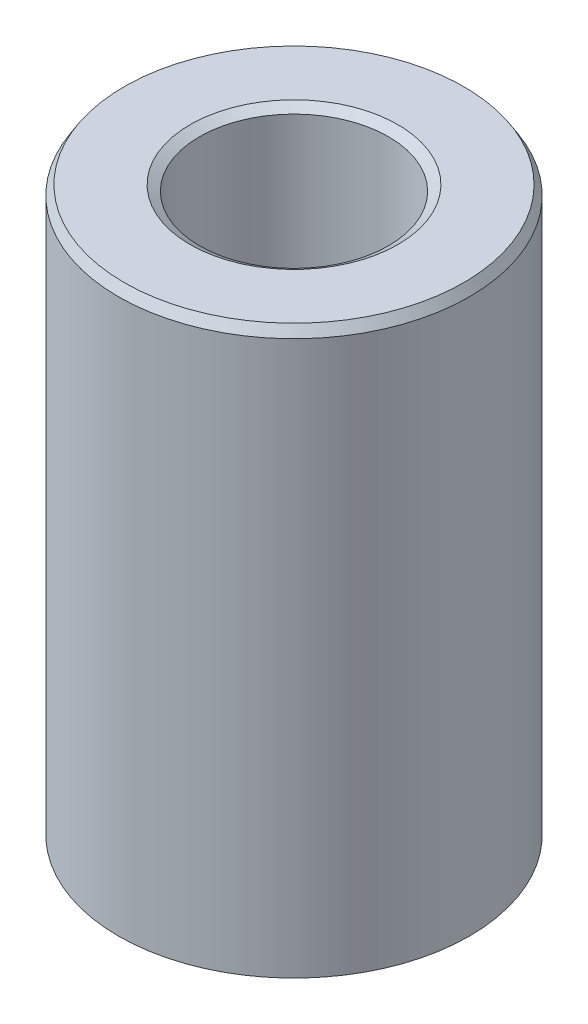
ISO-10303-21;
HEADER;
FILE_DESCRIPTION(('STEP AP214'),'2;1');
FILE_NAME('part.step','',(''),(''),'','','');
FILE_SCHEMA(('AUTOMOTIVE_DESIGN { 1 0 10303 214 1 1 1 1 }'));
ENDSEC;
DATA;
#1=APPLICATION_CONTEXT('core data for automotive mechanical design processes');
#2=APPLICATION_PROTOCOL_DEFINITION('international standard','automotive_design',2000,#1);
#3=PRODUCT_CONTEXT('',#1,'mechanical');
#4=PRODUCT('Part','Part','',(#3));
#5=PRODUCT_RELATED_PRODUCT_CATEGORY('part','',(#4));
#6=PRODUCT_DEFINITION_FORMATION('','',#4);
#7=PRODUCT_DEFINITION_CONTEXT('part definition',#1,'design');
#8=PRODUCT_DEFINITION('design','',#6,#7);
#9=PRODUCT_DEFINITION_SHAPE('','',#8);
#10=(LENGTH_UNIT() NAMED_UNIT(*) SI_UNIT(.MILLI.,.METRE.));
#11=(NAMED_UNIT(*) PLANE_ANGLE_UNIT() SI_UNIT($,.RADIAN.));
#12=(NAMED_UNIT(*) SI_UNIT($,.STERADIAN.) SOLID_ANGLE_UNIT());
#13=UNCERTAINTY_MEASURE_WITH_UNIT(LENGTH_MEASURE(1.E-05),#10,'distance_accuracy_value','');
#14=(GEOMETRIC_REPRESENTATION_CONTEXT(3) GLOBAL_UNCERTAINTY_ASSIGNED_CONTEXT((#13)) GLOBAL_UNIT_ASSIGNED_CONTEXT((#10,
#11,#12)) REPRESENTATION_CONTEXT('',''));
#15=CARTESIAN_POINT('',(0.,0.,0.));
#16=DIRECTION('',(0.,0.,1.));
#17=DIRECTION('',(1.,0.,0.));
#18=AXIS2_PLACEMENT_3D('',#15,#16,#17);
#19=CARTESIAN_POINT('',(0.,137.745571452695,0.));
#20=DIRECTION('',(0.,-1.,0.));
#21=DIRECTION('',(0.,0.,-1.));
#22=AXIS2_PLACEMENT_3D('',#19,#20,#21);
#23=CYLINDRICAL_SURFACE('',#22,42.5);
#24=CARTESIAN_POINT('',(0.,1.38865523834611,0.));
#25=DIRECTION('',(0.,1.,0.));
#26=DIRECTION('',(0.,0.,1.));
#27=AXIS2_PLACEMENT_3D('',#24,#25,#26);
#28=CIRCLE('',#27,42.5);
#29=CARTESIAN_POINT('',(0.,1.38865523834611,42.5));
#30=VERTEX_POINT('',#29);
#31=EDGE_CURVE('E10',#30,#30,#28,.T.);
#32=ORIENTED_EDGE('',*,*,#31,.T.);
#33=EDGE_LOOP('',(#32));
#34=FACE_BOUND('',#33,.T.);
#35=CARTESIAN_POINT('',(0.,135.471087232574,0.));
#36=DIRECTION('',(0.,1.,0.));
#37=DIRECTION('',(0.,0.,1.));
#38=AXIS2_PLACEMENT_3D('',#35,#36,#37);
#39=CIRCLE('',#38,42.5);
#40=CARTESIAN_POINT('',(0.,135.471087232574,42.5));
#41=VERTEX_POINT('',#40);
#42=EDGE_CURVE('E50',#41,#41,#39,.F.);
#43=ORIENTED_EDGE('',*,*,#42,.T.);
#44=EDGE_LOOP('',(#43));
#45=FACE_BOUND('',#44,.T.);
#46=ADVANCED_FACE('F39',(#34,#45),#23,.T.);
#47=CARTESIAN_POINT('',(0.,137.745571452695,0.));
#48=DIRECTION('',(0.,1.,0.));
#49=DIRECTION('',(0.,0.,1.));
#50=AXIS2_PLACEMENT_3D('',#47,#48,#49);
#51=PLANE('',#50);
#52=CARTESIAN_POINT('',(0.,137.745571452695,0.));
#53=DIRECTION('',(0.,1.,0.));
#54=DIRECTION('',(0.,0.,1.));
#55=AXIS2_PLACEMENT_3D('',#52,#53,#54);
#56=CIRCLE('',#55,25.1624900592609);
#57=CARTESIAN_POINT('',(0.,137.745571452695,25.1624900592609));
#58=VERTEX_POINT('',#57);
#59=EDGE_CURVE('E58',#58,#58,#56,.F.);
#60=ORIENTED_EDGE('',*,*,#59,.T.);
#61=EDGE_LOOP('',(#60));
#62=FACE_BOUND('',#61,.T.);
#63=CARTESIAN_POINT('',(0.,137.745571452695,0.));
#64=DIRECTION('',(0.,1.,0.));
#65=DIRECTION('',(0.,0.,1.));
#66=AXIS2_PLACEMENT_3D('',#63,#64,#65);
#67=CIRCLE('',#66,41.1113447616539);
#68=CARTESIAN_POINT('',(0.,137.745571452695,41.1113447616539));
#69=VERTEX_POINT('',#68);
#70=EDGE_CURVE('E61',#69,#69,#67,.T.);
#71=ORIENTED_EDGE('',*,*,#70,.T.);
#72=EDGE_LOOP('',(#71));
#73=FACE_BOUND('',#72,.T.);
#74=ADVANCED_FACE('F88',(#62,#73),#51,.T.);
#75=CARTESIAN_POINT('',(0.,0.,0.));
#76=DIRECTION('',(0.,1.,0.));
#77=DIRECTION('',(0.,0.,1.));
#78=AXIS2_PLACEMENT_3D('',#75,#76,#77);
#79=PLANE('',#78);
#80=CARTESIAN_POINT('',(0.,0.,0.));
#81=DIRECTION('',(0.,1.,0.));
#82=DIRECTION('',(0.,0.,1.));
#83=AXIS2_PLACEMENT_3D('',#80,#81,#82);
#84=CIRCLE('',#83,24.2766610774855);
#85=CARTESIAN_POINT('',(0.,0.,24.2766610774855));
#86=VERTEX_POINT('',#85);
#87=EDGE_CURVE('E51',#86,#86,#84,.T.);
#88=ORIENTED_EDGE('',*,*,#87,.T.);
#89=EDGE_LOOP('',(#88));
#90=FACE_BOUND('',#89,.T.);
#91=CARTESIAN_POINT('',(0.,0.,0.));
#92=DIRECTION('',(0.,1.,0.));
#93=DIRECTION('',(0.,0.,1.));
#94=AXIS2_PLACEMENT_3D('',#91,#92,#93);
#95=CIRCLE('',#94,40.2255157798784);
#96=CARTESIAN_POINT('',(0.,0.,40.2255157798784));
#97=VERTEX_POINT('',#96);
#98=EDGE_CURVE('E54',#97,#97,#95,.F.);
#99=ORIENTED_EDGE('',*,*,#98,.T.);
#100=EDGE_LOOP('',(#99));
#101=FACE_BOUND('',#100,.T.);
#102=ADVANCED_FACE('F83',(#90,#101),#79,.F.);
#103=CARTESIAN_POINT('',(0.,137.745571452695,0.));
#104=DIRECTION('',(0.,-1.,0.));
#105=DIRECTION('',(0.,0.,-1.));
#106=AXIS2_PLACEMENT_3D('',#103,#104,#105);
#107=CYLINDRICAL_SURFACE('',#106,22.8880058391393);
#108=CARTESIAN_POINT('',(0.,136.356916214349,0.));
#109=DIRECTION('',(0.,1.,0.));
#110=DIRECTION('',(0.,0.,1.));
#111=AXIS2_PLACEMENT_3D('',#108,#109,#110);
#112=CIRCLE('',#111,22.8880058391393);
#113=CARTESIAN_POINT('',(0.,136.356916214349,22.8880058391393));
#114=VERTEX_POINT('',#113);
#115=EDGE_CURVE('E67',#114,#114,#112,.T.);
#116=ORIENTED_EDGE('',*,*,#115,.T.);
#117=EDGE_LOOP('',(#116));
#118=FACE_BOUND('',#117,.T.);
#119=CARTESIAN_POINT('',(0.,2.27448422012161,0.));
#120=DIRECTION('',(0.,1.,0.));
#121=DIRECTION('',(0.,0.,1.));
#122=AXIS2_PLACEMENT_3D('',#119,#120,#121);
#123=CIRCLE('',#122,22.8880058391393);
#124=CARTESIAN_POINT('',(0.,2.27448422012161,22.8880058391393));
#125=VERTEX_POINT('',#124);
#126=EDGE_CURVE('E69',#125,#125,#123,.F.);
#127=ORIENTED_EDGE('',*,*,#126,.T.);
#128=EDGE_LOOP('',(#127));
#129=FACE_BOUND('',#128,.T.);
#130=ADVANCED_FACE('F71',(#118,#129),#107,.F.);
#131=CARTESIAN_POINT('',(0.,136.356916214349,0.));
#132=DIRECTION('',(0.,1.,0.));
#133=DIRECTION('',(0.,0.,1.));
#134=AXIS2_PLACEMENT_3D('',#131,#132,#133);
#135=CONICAL_SURFACE('',#134,22.8880058391393,1.02266552690806);
#136=ORIENTED_EDGE('',*,*,#59,.F.);
#137=EDGE_LOOP('',(#136));
#138=FACE_BOUND('',#137,.T.);
#139=ORIENTED_EDGE('',*,*,#115,.F.);
#140=EDGE_LOOP('',(#139));
#141=FACE_BOUND('',#140,.T.);
#142=ADVANCED_FACE('F77',(#138,#141),#135,.F.);
#143=CARTESIAN_POINT('',(0.,0.,0.));
#144=DIRECTION('',(0.,-1.,0.));
#145=DIRECTION('',(0.,0.,-1.));
#146=AXIS2_PLACEMENT_3D('',#143,#144,#145);
#147=CONICAL_SURFACE('',#146,24.2766610774855,0.548130799886833);
#148=ORIENTED_EDGE('',*,*,#126,.F.);
#149=EDGE_LOOP('',(#148));
#150=FACE_BOUND('',#149,.T.);
#151=ORIENTED_EDGE('',*,*,#87,.F.);
#152=EDGE_LOOP('',(#151));
#153=FACE_BOUND('',#152,.T.);
#154=ADVANCED_FACE('F73',(#150,#153),#147,.F.);
#155=CARTESIAN_POINT('',(0.,1.38865523834611,0.));
#156=DIRECTION('',(0.,1.,0.));
#157=DIRECTION('',(0.,0.,1.));
#158=AXIS2_PLACEMENT_3D('',#155,#156,#157);
#159=CONICAL_SURFACE('',#158,42.5,1.02266552690807);
#160=ORIENTED_EDGE('',*,*,#98,.F.);
#161=EDGE_LOOP('',(#160));
#162=FACE_BOUND('',#161,.T.);
#163=ORIENTED_EDGE('',*,*,#31,.F.);
#164=EDGE_LOOP('',(#163));
#165=FACE_BOUND('',#164,.T.);
#166=ADVANCED_FACE('F76',(#162,#165),#159,.T.);
#167=CARTESIAN_POINT('',(0.,137.745571452695,0.));
#168=DIRECTION('',(0.,-1.,0.));
#169=DIRECTION('',(0.,0.,-1.));
#170=AXIS2_PLACEMENT_3D('',#167,#168,#169);
#171=CONICAL_SURFACE('',#170,41.1113447616539,0.548130799886833);
#172=ORIENTED_EDGE('',*,*,#42,.F.);
#173=EDGE_LOOP('',(#172));
#174=FACE_BOUND('',#173,.T.);
#175=ORIENTED_EDGE('',*,*,#70,.F.);
#176=EDGE_LOOP('',(#175));
#177=FACE_BOUND('',#176,.T.);
#178=ADVANCED_FACE('F45',(#174,#177),#171,.T.);
#179=CLOSED_SHELL('',(#46,#74,#102,#130,#142,#154,#166,#178));
#180=MANIFOLD_SOLID_BREP('B2',#179);
#181=ADVANCED_BREP_SHAPE_REPRESENTATION('',(#18,#180),#14);
#182=SHAPE_DEFINITION_REPRESENTATION(#9,#181);
ENDSEC;
END-ISO-10303-21;
